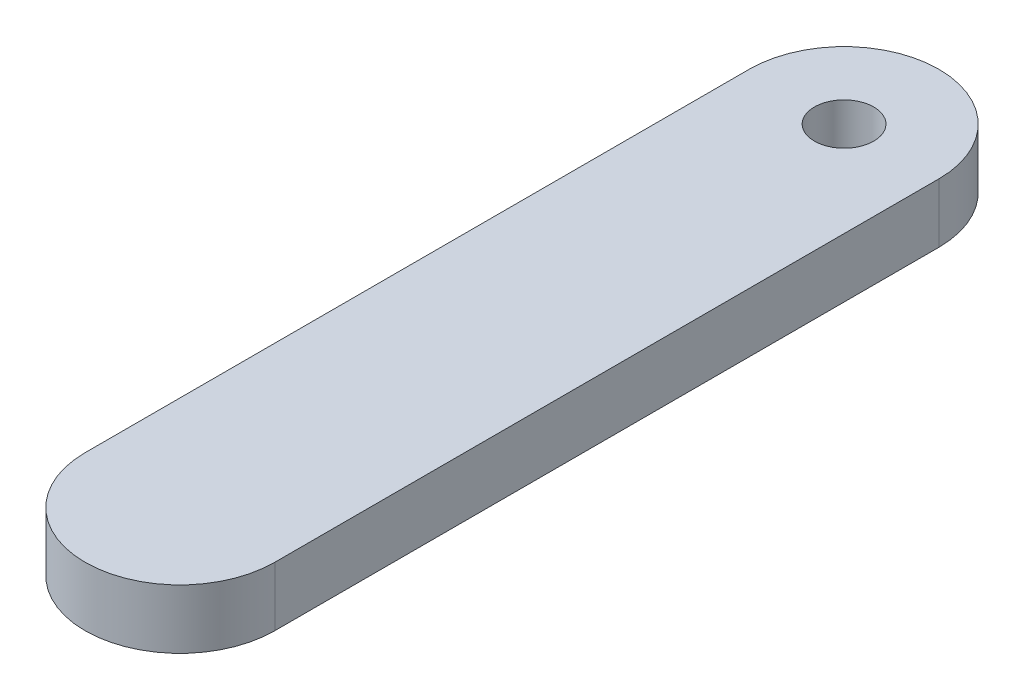
ISO-10303-21;
HEADER;
FILE_DESCRIPTION(('STEP AP214'),'2;1');
FILE_NAME('part.step','',(''),(''),'','','');
FILE_SCHEMA(('AUTOMOTIVE_DESIGN { 1 0 10303 214 1 1 1 1 }'));
ENDSEC;
DATA;
#1=APPLICATION_CONTEXT('core data for automotive mechanical design processes');
#2=APPLICATION_PROTOCOL_DEFINITION('international standard','automotive_design',2000,#1);
#3=PRODUCT_CONTEXT('',#1,'mechanical');
#4=PRODUCT('Part','Part','',(#3));
#5=PRODUCT_RELATED_PRODUCT_CATEGORY('part','',(#4));
#6=PRODUCT_DEFINITION_FORMATION('','',#4);
#7=PRODUCT_DEFINITION_CONTEXT('part definition',#1,'design');
#8=PRODUCT_DEFINITION('design','',#6,#7);
#9=PRODUCT_DEFINITION_SHAPE('','',#8);
#10=(LENGTH_UNIT() NAMED_UNIT(*) SI_UNIT(.MILLI.,.METRE.));
#11=(NAMED_UNIT(*) PLANE_ANGLE_UNIT() SI_UNIT($,.RADIAN.));
#12=(NAMED_UNIT(*) SI_UNIT($,.STERADIAN.) SOLID_ANGLE_UNIT());
#13=UNCERTAINTY_MEASURE_WITH_UNIT(LENGTH_MEASURE(1.E-05),#10,'distance_accuracy_value','');
#14=(GEOMETRIC_REPRESENTATION_CONTEXT(3) GLOBAL_UNCERTAINTY_ASSIGNED_CONTEXT((#13)) GLOBAL_UNIT_ASSIGNED_CONTEXT((#10,
#11,#12)) REPRESENTATION_CONTEXT('',''));
#15=CARTESIAN_POINT('',(0.,0.,0.));
#16=DIRECTION('',(0.,0.,1.));
#17=DIRECTION('',(1.,0.,0.));
#18=AXIS2_PLACEMENT_3D('',#15,#16,#17);
#19=CARTESIAN_POINT('',(0.,2.5,0.));
#20=DIRECTION('',(0.,1.,0.));
#21=DIRECTION('',(0.,0.,1.));
#22=AXIS2_PLACEMENT_3D('',#19,#20,#21);
#23=PLANE('',#22);
#24=CARTESIAN_POINT('',(0.,2.5,0.));
#25=DIRECTION('',(0.,1.,0.));
#26=DIRECTION('',(0.,0.,1.));
#27=AXIS2_PLACEMENT_3D('',#24,#25,#26);
#28=CIRCLE('',#27,4.);
#29=CARTESIAN_POINT('',(-4.,2.5,0.));
#30=VERTEX_POINT('',#29);
#31=CARTESIAN_POINT('',(4.,2.5,0.));
#32=VERTEX_POINT('',#31);
#33=EDGE_CURVE('E86',#30,#32,#28,.T.);
#34=ORIENTED_EDGE('',*,*,#33,.T.);
#35=DIRECTION('',(0.,0.,-1.));
#36=VECTOR('',#35,1.);
#37=CARTESIAN_POINT('',(4.,2.5,0.));
#38=LINE('',#37,#36);
#39=CARTESIAN_POINT('',(4.,2.5,-28.));
#40=VERTEX_POINT('',#39);
#41=EDGE_CURVE('E81',#32,#40,#38,.T.);
#42=ORIENTED_EDGE('',*,*,#41,.T.);
#43=CARTESIAN_POINT('',(0.,2.5,-28.));
#44=DIRECTION('',(0.,1.,0.));
#45=DIRECTION('',(0.,0.,1.));
#46=AXIS2_PLACEMENT_3D('',#43,#44,#45);
#47=CIRCLE('',#46,4.);
#48=CARTESIAN_POINT('',(-4.,2.5,-28.));
#49=VERTEX_POINT('',#48);
#50=EDGE_CURVE('E84',#40,#49,#47,.T.);
#51=ORIENTED_EDGE('',*,*,#50,.T.);
#52=DIRECTION('',(0.,0.,1.));
#53=VECTOR('',#52,1.);
#54=CARTESIAN_POINT('',(-4.,2.5,0.));
#55=LINE('',#54,#53);
#56=EDGE_CURVE('E50',#49,#30,#55,.T.);
#57=ORIENTED_EDGE('',*,*,#56,.T.);
#58=EDGE_LOOP('',(#34,#42,#51,#57));
#59=FACE_BOUND('',#58,.T.);
#60=CARTESIAN_POINT('',(0.,2.5,-28.));
#61=DIRECTION('',(0.,1.,0.));
#62=DIRECTION('',(0.,0.,1.));
#63=AXIS2_PLACEMENT_3D('',#60,#61,#62);
#64=CIRCLE('',#63,1.25);
#65=CARTESIAN_POINT('',(0.,2.5,-26.75));
#66=VERTEX_POINT('',#65);
#67=EDGE_CURVE('E103',#66,#66,#64,.T.);
#68=ORIENTED_EDGE('',*,*,#67,.F.);
#69=EDGE_LOOP('',(#68));
#70=FACE_BOUND('',#69,.T.);
#71=ADVANCED_FACE('F33',(#59,#70),#23,.T.);
#72=CARTESIAN_POINT('',(0.,0.,0.));
#73=DIRECTION('',(0.,1.,0.));
#74=DIRECTION('',(0.,0.,1.));
#75=AXIS2_PLACEMENT_3D('',#72,#73,#74);
#76=PLANE('',#75);
#77=CARTESIAN_POINT('',(0.,0.,0.));
#78=DIRECTION('',(0.,1.,0.));
#79=DIRECTION('',(0.,0.,1.));
#80=AXIS2_PLACEMENT_3D('',#77,#78,#79);
#81=CIRCLE('',#80,1.25);
#82=CARTESIAN_POINT('',(0.,0.,1.25));
#83=VERTEX_POINT('',#82);
#84=EDGE_CURVE('E11',#83,#83,#81,.F.);
#85=ORIENTED_EDGE('',*,*,#84,.F.);
#86=EDGE_LOOP('',(#85));
#87=FACE_BOUND('',#86,.T.);
#88=CARTESIAN_POINT('',(0.,0.,0.));
#89=DIRECTION('',(0.,1.,0.));
#90=DIRECTION('',(0.,0.,1.));
#91=AXIS2_PLACEMENT_3D('',#88,#89,#90);
#92=CIRCLE('',#91,4.);
#93=CARTESIAN_POINT('',(-4.,0.,0.));
#94=VERTEX_POINT('',#93);
#95=CARTESIAN_POINT('',(4.,0.,0.));
#96=VERTEX_POINT('',#95);
#97=EDGE_CURVE('E100',#94,#96,#92,.T.);
#98=ORIENTED_EDGE('',*,*,#97,.F.);
#99=DIRECTION('',(0.,0.,1.));
#100=VECTOR('',#99,1.);
#101=CARTESIAN_POINT('',(-4.,0.,0.));
#102=LINE('',#101,#100);
#103=CARTESIAN_POINT('',(-4.,0.,-28.));
#104=VERTEX_POINT('',#103);
#105=EDGE_CURVE('E73',#104,#94,#102,.T.);
#106=ORIENTED_EDGE('',*,*,#105,.F.);
#107=CARTESIAN_POINT('',(0.,0.,-28.));
#108=DIRECTION('',(0.,1.,0.));
#109=DIRECTION('',(0.,0.,1.));
#110=AXIS2_PLACEMENT_3D('',#107,#108,#109);
#111=CIRCLE('',#110,4.);
#112=CARTESIAN_POINT('',(4.,0.,-28.));
#113=VERTEX_POINT('',#112);
#114=EDGE_CURVE('E67',#113,#104,#111,.T.);
#115=ORIENTED_EDGE('',*,*,#114,.F.);
#116=DIRECTION('',(0.,0.,-1.));
#117=VECTOR('',#116,1.);
#118=CARTESIAN_POINT('',(4.,0.,0.));
#119=LINE('',#118,#117);
#120=EDGE_CURVE('E91',#96,#113,#119,.T.);
#121=ORIENTED_EDGE('',*,*,#120,.F.);
#122=EDGE_LOOP('',(#98,#106,#115,#121));
#123=FACE_BOUND('',#122,.T.);
#124=CARTESIAN_POINT('',(0.,0.,-28.));
#125=DIRECTION('',(0.,1.,0.));
#126=DIRECTION('',(0.,0.,1.));
#127=AXIS2_PLACEMENT_3D('',#124,#125,#126);
#128=CIRCLE('',#127,1.25);
#129=CARTESIAN_POINT('',(0.,0.,-26.75));
#130=VERTEX_POINT('',#129);
#131=EDGE_CURVE('E118',#130,#130,#128,.T.);
#132=ORIENTED_EDGE('',*,*,#131,.T.);
#133=EDGE_LOOP('',(#132));
#134=FACE_BOUND('',#133,.T.);
#135=ADVANCED_FACE('F111',(#87,#123,#134),#76,.F.);
#136=CARTESIAN_POINT('',(0.,2.5,0.));
#137=DIRECTION('',(0.,-1.,0.));
#138=DIRECTION('',(0.,0.,-1.));
#139=AXIS2_PLACEMENT_3D('',#136,#137,#138);
#140=CYLINDRICAL_SURFACE('',#139,4.);
#141=ORIENTED_EDGE('',*,*,#97,.T.);
#142=DIRECTION('',(0.,-1.,0.));
#143=VECTOR('',#142,1.);
#144=CARTESIAN_POINT('',(4.,2.5,0.));
#145=LINE('',#144,#143);
#146=EDGE_CURVE('E42',#32,#96,#145,.T.);
#147=ORIENTED_EDGE('',*,*,#146,.F.);
#148=ORIENTED_EDGE('',*,*,#33,.F.);
#149=DIRECTION('',(0.,-1.,0.));
#150=VECTOR('',#149,1.);
#151=CARTESIAN_POINT('',(-4.,2.5,0.));
#152=LINE('',#151,#150);
#153=EDGE_CURVE('E96',#30,#94,#152,.T.);
#154=ORIENTED_EDGE('',*,*,#153,.T.);
#155=EDGE_LOOP('',(#141,#147,#148,#154));
#156=FACE_BOUND('',#155,.T.);
#157=ADVANCED_FACE('F35',(#156),#140,.T.);
#158=CARTESIAN_POINT('',(4.,2.5,0.));
#159=DIRECTION('',(-1.,0.,0.));
#160=DIRECTION('',(0.,0.,1.));
#161=AXIS2_PLACEMENT_3D('',#158,#159,#160);
#162=PLANE('',#161);
#163=ORIENTED_EDGE('',*,*,#120,.T.);
#164=DIRECTION('',(0.,-1.,0.));
#165=VECTOR('',#164,1.);
#166=CARTESIAN_POINT('',(4.,2.5,-28.));
#167=LINE('',#166,#165);
#168=EDGE_CURVE('E89',#40,#113,#167,.T.);
#169=ORIENTED_EDGE('',*,*,#168,.F.);
#170=ORIENTED_EDGE('',*,*,#41,.F.);
#171=ORIENTED_EDGE('',*,*,#146,.T.);
#172=EDGE_LOOP('',(#163,#169,#170,#171));
#173=FACE_BOUND('',#172,.T.);
#174=ADVANCED_FACE('F90',(#173),#162,.F.);
#175=CARTESIAN_POINT('',(0.,2.5,-28.));
#176=DIRECTION('',(0.,-1.,0.));
#177=DIRECTION('',(0.,0.,-1.));
#178=AXIS2_PLACEMENT_3D('',#175,#176,#177);
#179=CYLINDRICAL_SURFACE('',#178,4.);
#180=ORIENTED_EDGE('',*,*,#114,.T.);
#181=DIRECTION('',(0.,-1.,0.));
#182=VECTOR('',#181,1.);
#183=CARTESIAN_POINT('',(-4.,2.5,-28.));
#184=LINE('',#183,#182);
#185=EDGE_CURVE('E92',#49,#104,#184,.T.);
#186=ORIENTED_EDGE('',*,*,#185,.F.);
#187=ORIENTED_EDGE('',*,*,#50,.F.);
#188=ORIENTED_EDGE('',*,*,#168,.T.);
#189=EDGE_LOOP('',(#180,#186,#187,#188));
#190=FACE_BOUND('',#189,.T.);
#191=ADVANCED_FACE('F94',(#190),#179,.T.);
#192=CARTESIAN_POINT('',(-4.,2.5,0.));
#193=DIRECTION('',(1.,0.,0.));
#194=DIRECTION('',(0.,0.,-1.));
#195=AXIS2_PLACEMENT_3D('',#192,#193,#194);
#196=PLANE('',#195);
#197=ORIENTED_EDGE('',*,*,#105,.T.);
#198=ORIENTED_EDGE('',*,*,#153,.F.);
#199=ORIENTED_EDGE('',*,*,#56,.F.);
#200=ORIENTED_EDGE('',*,*,#185,.T.);
#201=EDGE_LOOP('',(#197,#198,#199,#200));
#202=FACE_BOUND('',#201,.T.);
#203=ADVANCED_FACE('F141',(#202),#196,.F.);
#204=CARTESIAN_POINT('',(0.,2.5,-28.));
#205=DIRECTION('',(0.,-1.,0.));
#206=DIRECTION('',(0.,0.,-1.));
#207=AXIS2_PLACEMENT_3D('',#204,#205,#206);
#208=CYLINDRICAL_SURFACE('',#207,1.25);
#209=ORIENTED_EDGE('',*,*,#67,.T.);
#210=EDGE_LOOP('',(#209));
#211=FACE_BOUND('',#210,.T.);
#212=ORIENTED_EDGE('',*,*,#131,.F.);
#213=EDGE_LOOP('',(#212));
#214=FACE_BOUND('',#213,.T.);
#215=ADVANCED_FACE('F133',(#211,#214),#208,.F.);
#216=CARTESIAN_POINT('',(0.,-1.25,0.));
#217=DIRECTION('',(0.,1.,0.));
#218=DIRECTION('',(0.,0.,1.));
#219=AXIS2_PLACEMENT_3D('',#216,#217,#218);
#220=CYLINDRICAL_SURFACE('',#219,1.25);
#221=CARTESIAN_POINT('',(0.,-1.25,0.));
#222=DIRECTION('',(0.,-1.,0.));
#223=DIRECTION('',(0.,0.,-1.));
#224=AXIS2_PLACEMENT_3D('',#221,#222,#223);
#225=CIRCLE('',#224,1.25);
#226=CARTESIAN_POINT('',(0.,-1.25,-1.25));
#227=VERTEX_POINT('',#226);
#228=EDGE_CURVE('E120',#227,#227,#225,.T.);
#229=ORIENTED_EDGE('',*,*,#228,.F.);
#230=EDGE_LOOP('',(#229));
#231=FACE_BOUND('',#230,.T.);
#232=ORIENTED_EDGE('',*,*,#84,.T.);
#233=EDGE_LOOP('',(#232));
#234=FACE_BOUND('',#233,.T.);
#235=ADVANCED_FACE('F130',(#231,#234),#220,.T.);
#236=CARTESIAN_POINT('',(0.,-1.25,0.));
#237=DIRECTION('',(0.,-1.,0.));
#238=DIRECTION('',(0.,0.,-1.));
#239=AXIS2_PLACEMENT_3D('',#236,#237,#238);
#240=PLANE('',#239);
#241=ORIENTED_EDGE('',*,*,#228,.T.);
#242=EDGE_LOOP('',(#241));
#243=FACE_BOUND('',#242,.T.);
#244=ADVANCED_FACE('F128',(#243),#240,.T.);
#245=CLOSED_SHELL('',(#71,#135,#157,#174,#191,#203,#215,#235,#244));
#246=MANIFOLD_SOLID_BREP('B2',#245);
#247=ADVANCED_BREP_SHAPE_REPRESENTATION('',(#18,#246),#14);
#248=SHAPE_DEFINITION_REPRESENTATION(#9,#247);
ENDSEC;
END-ISO-10303-21;
